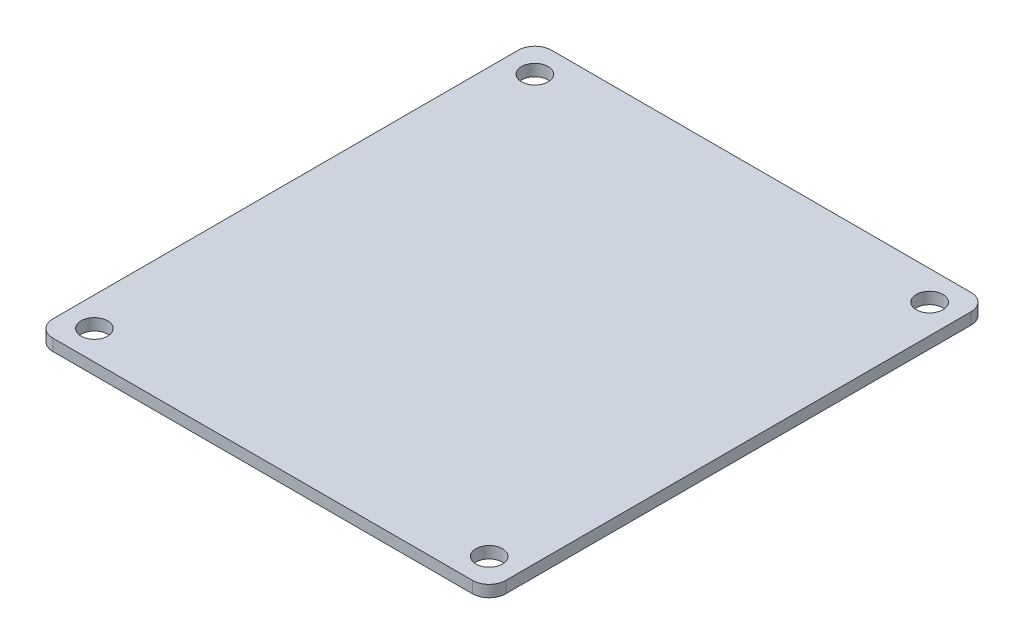
ISO-10303-21;
HEADER;
FILE_DESCRIPTION(('STEP AP214'),'2;1');
FILE_NAME('part.step','',(''),(''),'','','');
FILE_SCHEMA(('AUTOMOTIVE_DESIGN { 1 0 10303 214 1 1 1 1 }'));
ENDSEC;
DATA;
#1=APPLICATION_CONTEXT('core data for automotive mechanical design processes');
#2=APPLICATION_PROTOCOL_DEFINITION('international standard','automotive_design',2000,#1);
#3=PRODUCT_CONTEXT('',#1,'mechanical');
#4=PRODUCT('Part','Part','',(#3));
#5=PRODUCT_RELATED_PRODUCT_CATEGORY('part','',(#4));
#6=PRODUCT_DEFINITION_FORMATION('','',#4);
#7=PRODUCT_DEFINITION_CONTEXT('part definition',#1,'design');
#8=PRODUCT_DEFINITION('design','',#6,#7);
#9=PRODUCT_DEFINITION_SHAPE('','',#8);
#10=(LENGTH_UNIT() NAMED_UNIT(*) SI_UNIT(.MILLI.,.METRE.));
#11=(NAMED_UNIT(*) PLANE_ANGLE_UNIT() SI_UNIT($,.RADIAN.));
#12=(NAMED_UNIT(*) SI_UNIT($,.STERADIAN.) SOLID_ANGLE_UNIT());
#13=UNCERTAINTY_MEASURE_WITH_UNIT(LENGTH_MEASURE(1.E-05),#10,'distance_accuracy_value','');
#14=(GEOMETRIC_REPRESENTATION_CONTEXT(3) GLOBAL_UNCERTAINTY_ASSIGNED_CONTEXT((#13)) GLOBAL_UNIT_ASSIGNED_CONTEXT((#10,
#11,#12)) REPRESENTATION_CONTEXT('',''));
#15=CARTESIAN_POINT('',(0.,0.,0.));
#16=DIRECTION('',(0.,0.,1.));
#17=DIRECTION('',(1.,0.,0.));
#18=AXIS2_PLACEMENT_3D('',#15,#16,#17);
#19=CARTESIAN_POINT('',(-27.25,1.4,30.));
#20=DIRECTION('',(1.,0.,0.));
#21=DIRECTION('',(0.,0.,-1.));
#22=AXIS2_PLACEMENT_3D('',#19,#20,#21);
#23=PLANE('',#22);
#24=DIRECTION('',(0.,0.,1.));
#25=VECTOR('',#24,1.);
#26=CARTESIAN_POINT('',(-27.25,1.4,30.));
#27=LINE('',#26,#25);
#28=CARTESIAN_POINT('',(-27.25,1.4,-28.));
#29=VERTEX_POINT('',#28);
#30=CARTESIAN_POINT('',(-27.25,1.4,28.));
#31=VERTEX_POINT('',#30);
#32=EDGE_CURVE('E124',#29,#31,#27,.T.);
#33=ORIENTED_EDGE('',*,*,#32,.F.);
#34=DIRECTION('',(0.,-1.,0.));
#35=VECTOR('',#34,1.);
#36=CARTESIAN_POINT('',(-27.25,1.4,-28.));
#37=LINE('',#36,#35);
#38=CARTESIAN_POINT('',(-27.25,0.,-28.));
#39=VERTEX_POINT('',#38);
#40=EDGE_CURVE('E150',#29,#39,#37,.T.);
#41=ORIENTED_EDGE('',*,*,#40,.T.);
#42=DIRECTION('',(0.,0.,1.));
#43=VECTOR('',#42,1.);
#44=CARTESIAN_POINT('',(-27.25,0.,30.));
#45=LINE('',#44,#43);
#46=CARTESIAN_POINT('',(-27.25,0.,28.));
#47=VERTEX_POINT('',#46);
#48=EDGE_CURVE('E158',#39,#47,#45,.T.);
#49=ORIENTED_EDGE('',*,*,#48,.T.);
#50=DIRECTION('',(0.,-1.,0.));
#51=VECTOR('',#50,1.);
#52=CARTESIAN_POINT('',(-27.25,1.4,28.));
#53=LINE('',#52,#51);
#54=EDGE_CURVE('E148',#47,#31,#53,.F.);
#55=ORIENTED_EDGE('',*,*,#54,.T.);
#56=EDGE_LOOP('',(#33,#41,#49,#55));
#57=FACE_BOUND('',#56,.T.);
#58=ADVANCED_FACE('F33',(#57),#23,.F.);
#59=CARTESIAN_POINT('',(27.25,1.4,30.));
#60=DIRECTION('',(0.,0.,-1.));
#61=DIRECTION('',(-1.,0.,0.));
#62=AXIS2_PLACEMENT_3D('',#59,#60,#61);
#63=PLANE('',#62);
#64=DIRECTION('',(1.,0.,0.));
#65=VECTOR('',#64,1.);
#66=CARTESIAN_POINT('',(27.25,0.,30.));
#67=LINE('',#66,#65);
#68=CARTESIAN_POINT('',(-25.25,0.,30.));
#69=VERTEX_POINT('',#68);
#70=CARTESIAN_POINT('',(25.25,0.,30.));
#71=VERTEX_POINT('',#70);
#72=EDGE_CURVE('E129',#69,#71,#67,.T.);
#73=ORIENTED_EDGE('',*,*,#72,.T.);
#74=DIRECTION('',(0.,-1.,0.));
#75=VECTOR('',#74,1.);
#76=CARTESIAN_POINT('',(25.25,1.4,30.));
#77=LINE('',#76,#75);
#78=CARTESIAN_POINT('',(25.25,1.4,30.));
#79=VERTEX_POINT('',#78);
#80=EDGE_CURVE('E11',#71,#79,#77,.F.);
#81=ORIENTED_EDGE('',*,*,#80,.T.);
#82=DIRECTION('',(1.,0.,0.));
#83=VECTOR('',#82,1.);
#84=CARTESIAN_POINT('',(27.25,1.4,30.));
#85=LINE('',#84,#83);
#86=CARTESIAN_POINT('',(-25.25,1.4,30.));
#87=VERTEX_POINT('',#86);
#88=EDGE_CURVE('E127',#87,#79,#85,.T.);
#89=ORIENTED_EDGE('',*,*,#88,.F.);
#90=DIRECTION('',(0.,-1.,0.));
#91=VECTOR('',#90,1.);
#92=CARTESIAN_POINT('',(-25.25,1.4,30.));
#93=LINE('',#92,#91);
#94=EDGE_CURVE('E41',#87,#69,#93,.T.);
#95=ORIENTED_EDGE('',*,*,#94,.T.);
#96=EDGE_LOOP('',(#73,#81,#89,#95));
#97=FACE_BOUND('',#96,.T.);
#98=ADVANCED_FACE('F155',(#97),#63,.F.);
#99=CARTESIAN_POINT('',(27.25,1.4,30.));
#100=DIRECTION('',(-1.,0.,0.));
#101=DIRECTION('',(0.,0.,1.));
#102=AXIS2_PLACEMENT_3D('',#99,#100,#101);
#103=PLANE('',#102);
#104=DIRECTION('',(0.,0.,-1.));
#105=VECTOR('',#104,1.);
#106=CARTESIAN_POINT('',(27.25,0.,30.));
#107=LINE('',#106,#105);
#108=CARTESIAN_POINT('',(27.25,0.,28.));
#109=VERTEX_POINT('',#108);
#110=CARTESIAN_POINT('',(27.25,0.,-28.));
#111=VERTEX_POINT('',#110);
#112=EDGE_CURVE('E125',#109,#111,#107,.T.);
#113=ORIENTED_EDGE('',*,*,#112,.T.);
#114=DIRECTION('',(0.,-1.,0.));
#115=VECTOR('',#114,1.);
#116=CARTESIAN_POINT('',(27.25,1.4,-28.));
#117=LINE('',#116,#115);
#118=CARTESIAN_POINT('',(27.25,1.4,-28.));
#119=VERTEX_POINT('',#118);
#120=EDGE_CURVE('E103',#111,#119,#117,.F.);
#121=ORIENTED_EDGE('',*,*,#120,.T.);
#122=DIRECTION('',(0.,0.,-1.));
#123=VECTOR('',#122,1.);
#124=CARTESIAN_POINT('',(27.25,1.4,30.));
#125=LINE('',#124,#123);
#126=CARTESIAN_POINT('',(27.25,1.4,28.));
#127=VERTEX_POINT('',#126);
#128=EDGE_CURVE('E163',#127,#119,#125,.T.);
#129=ORIENTED_EDGE('',*,*,#128,.F.);
#130=DIRECTION('',(0.,-1.,0.));
#131=VECTOR('',#130,1.);
#132=CARTESIAN_POINT('',(27.25,1.4,28.));
#133=LINE('',#132,#131);
#134=EDGE_CURVE('E108',#127,#109,#133,.T.);
#135=ORIENTED_EDGE('',*,*,#134,.T.);
#136=EDGE_LOOP('',(#113,#121,#129,#135));
#137=FACE_BOUND('',#136,.T.);
#138=ADVANCED_FACE('F211',(#137),#103,.F.);
#139=CARTESIAN_POINT('',(27.25,1.4,-30.));
#140=DIRECTION('',(0.,0.,1.));
#141=DIRECTION('',(1.,0.,0.));
#142=AXIS2_PLACEMENT_3D('',#139,#140,#141);
#143=PLANE('',#142);
#144=DIRECTION('',(-1.,0.,0.));
#145=VECTOR('',#144,1.);
#146=CARTESIAN_POINT('',(27.25,1.4,-30.));
#147=LINE('',#146,#145);
#148=CARTESIAN_POINT('',(25.25,1.4,-30.));
#149=VERTEX_POINT('',#148);
#150=CARTESIAN_POINT('',(-25.25,1.4,-30.));
#151=VERTEX_POINT('',#150);
#152=EDGE_CURVE('E118',#149,#151,#147,.T.);
#153=ORIENTED_EDGE('',*,*,#152,.F.);
#154=DIRECTION('',(0.,-1.,0.));
#155=VECTOR('',#154,1.);
#156=CARTESIAN_POINT('',(25.25,1.4,-30.));
#157=LINE('',#156,#155);
#158=CARTESIAN_POINT('',(25.25,0.,-30.));
#159=VERTEX_POINT('',#158);
#160=EDGE_CURVE('E102',#149,#159,#157,.T.);
#161=ORIENTED_EDGE('',*,*,#160,.T.);
#162=DIRECTION('',(-1.,0.,0.));
#163=VECTOR('',#162,1.);
#164=CARTESIAN_POINT('',(27.25,0.,-30.));
#165=LINE('',#164,#163);
#166=CARTESIAN_POINT('',(-25.25,0.,-30.));
#167=VERTEX_POINT('',#166);
#168=EDGE_CURVE('E115',#159,#167,#165,.T.);
#169=ORIENTED_EDGE('',*,*,#168,.T.);
#170=DIRECTION('',(0.,-1.,0.));
#171=VECTOR('',#170,1.);
#172=CARTESIAN_POINT('',(-25.25,1.4,-30.));
#173=LINE('',#172,#171);
#174=EDGE_CURVE('E120',#167,#151,#173,.F.);
#175=ORIENTED_EDGE('',*,*,#174,.T.);
#176=EDGE_LOOP('',(#153,#161,#169,#175));
#177=FACE_BOUND('',#176,.T.);
#178=ADVANCED_FACE('F114',(#177),#143,.F.);
#179=CARTESIAN_POINT('',(0.,1.4,0.));
#180=DIRECTION('',(0.,1.,0.));
#181=DIRECTION('',(0.,0.,1.));
#182=AXIS2_PLACEMENT_3D('',#179,#180,#181);
#183=PLANE('',#182);
#184=CARTESIAN_POINT('',(23.75,1.4,26.5));
#185=DIRECTION('',(0.,1.,0.));
#186=DIRECTION('',(0.,0.,1.));
#187=AXIS2_PLACEMENT_3D('',#184,#185,#186);
#188=CIRCLE('',#187,1.6);
#189=CARTESIAN_POINT('',(23.75,1.4,28.1));
#190=VERTEX_POINT('',#189);
#191=EDGE_CURVE('E173',#190,#190,#188,.T.);
#192=ORIENTED_EDGE('',*,*,#191,.F.);
#193=EDGE_LOOP('',(#192));
#194=FACE_BOUND('',#193,.T.);
#195=CARTESIAN_POINT('',(-23.75,1.4,-26.5));
#196=DIRECTION('',(0.,1.,0.));
#197=DIRECTION('',(0.,0.,1.));
#198=AXIS2_PLACEMENT_3D('',#195,#196,#197);
#199=CIRCLE('',#198,1.6);
#200=CARTESIAN_POINT('',(-23.75,1.4,-24.9));
#201=VERTEX_POINT('',#200);
#202=EDGE_CURVE('E179',#201,#201,#199,.T.);
#203=ORIENTED_EDGE('',*,*,#202,.F.);
#204=EDGE_LOOP('',(#203));
#205=FACE_BOUND('',#204,.T.);
#206=CARTESIAN_POINT('',(-23.75,1.4,26.5));
#207=DIRECTION('',(0.,1.,0.));
#208=DIRECTION('',(0.,0.,1.));
#209=AXIS2_PLACEMENT_3D('',#206,#207,#208);
#210=CIRCLE('',#209,1.6);
#211=CARTESIAN_POINT('',(-23.75,1.4,28.1));
#212=VERTEX_POINT('',#211);
#213=EDGE_CURVE('E185',#212,#212,#210,.T.);
#214=ORIENTED_EDGE('',*,*,#213,.F.);
#215=EDGE_LOOP('',(#214));
#216=FACE_BOUND('',#215,.T.);
#217=CARTESIAN_POINT('',(23.75,1.4,-26.5));
#218=DIRECTION('',(0.,1.,0.));
#219=DIRECTION('',(0.,0.,1.));
#220=AXIS2_PLACEMENT_3D('',#217,#218,#219);
#221=CIRCLE('',#220,1.6);
#222=CARTESIAN_POINT('',(23.75,1.4,-24.9));
#223=VERTEX_POINT('',#222);
#224=EDGE_CURVE('E167',#223,#223,#221,.T.);
#225=ORIENTED_EDGE('',*,*,#224,.F.);
#226=EDGE_LOOP('',(#225));
#227=FACE_BOUND('',#226,.T.);
#228=ORIENTED_EDGE('',*,*,#128,.T.);
#229=CARTESIAN_POINT('',(25.25,1.4,-28.));
#230=DIRECTION('',(0.,1.,0.));
#231=DIRECTION('',(0.,0.,1.));
#232=AXIS2_PLACEMENT_3D('',#229,#230,#231);
#233=CIRCLE('',#232,2.);
#234=EDGE_CURVE('E146',#119,#149,#233,.T.);
#235=ORIENTED_EDGE('',*,*,#234,.T.);
#236=ORIENTED_EDGE('',*,*,#152,.T.);
#237=CARTESIAN_POINT('',(-25.25,1.4,-28.));
#238=DIRECTION('',(0.,1.,0.));
#239=DIRECTION('',(0.,0.,1.));
#240=AXIS2_PLACEMENT_3D('',#237,#238,#239);
#241=CIRCLE('',#240,2.);
#242=EDGE_CURVE('E144',#151,#29,#241,.T.);
#243=ORIENTED_EDGE('',*,*,#242,.T.);
#244=ORIENTED_EDGE('',*,*,#32,.T.);
#245=CARTESIAN_POINT('',(-25.25,1.4,28.));
#246=DIRECTION('',(0.,1.,0.));
#247=DIRECTION('',(0.,0.,1.));
#248=AXIS2_PLACEMENT_3D('',#245,#246,#247);
#249=CIRCLE('',#248,2.);
#250=EDGE_CURVE('E53',#31,#87,#249,.T.);
#251=ORIENTED_EDGE('',*,*,#250,.T.);
#252=ORIENTED_EDGE('',*,*,#88,.T.);
#253=CARTESIAN_POINT('',(25.25,1.4,28.));
#254=DIRECTION('',(0.,1.,0.));
#255=DIRECTION('',(0.,0.,1.));
#256=AXIS2_PLACEMENT_3D('',#253,#254,#255);
#257=CIRCLE('',#256,2.);
#258=EDGE_CURVE('E142',#79,#127,#257,.T.);
#259=ORIENTED_EDGE('',*,*,#258,.T.);
#260=EDGE_LOOP('',(#228,#235,#236,#243,#244,#251,#252,#259));
#261=FACE_BOUND('',#260,.T.);
#262=ADVANCED_FACE('F201',(#194,#205,#216,#227,#261),#183,.T.);
#263=CARTESIAN_POINT('',(0.,0.,0.));
#264=DIRECTION('',(0.,1.,0.));
#265=DIRECTION('',(0.,0.,1.));
#266=AXIS2_PLACEMENT_3D('',#263,#264,#265);
#267=PLANE('',#266);
#268=CARTESIAN_POINT('',(23.75,0.,26.5));
#269=DIRECTION('',(0.,1.,0.));
#270=DIRECTION('',(0.,0.,1.));
#271=AXIS2_PLACEMENT_3D('',#268,#269,#270);
#272=CIRCLE('',#271,1.6);
#273=CARTESIAN_POINT('',(23.75,0.,28.1));
#274=VERTEX_POINT('',#273);
#275=EDGE_CURVE('E176',#274,#274,#272,.T.);
#276=ORIENTED_EDGE('',*,*,#275,.T.);
#277=EDGE_LOOP('',(#276));
#278=FACE_BOUND('',#277,.T.);
#279=CARTESIAN_POINT('',(-23.75,0.,-26.5));
#280=DIRECTION('',(0.,1.,0.));
#281=DIRECTION('',(0.,0.,1.));
#282=AXIS2_PLACEMENT_3D('',#279,#280,#281);
#283=CIRCLE('',#282,1.6);
#284=CARTESIAN_POINT('',(-23.75,0.,-24.9));
#285=VERTEX_POINT('',#284);
#286=EDGE_CURVE('E182',#285,#285,#283,.T.);
#287=ORIENTED_EDGE('',*,*,#286,.T.);
#288=EDGE_LOOP('',(#287));
#289=FACE_BOUND('',#288,.T.);
#290=CARTESIAN_POINT('',(-23.75,0.,26.5));
#291=DIRECTION('',(0.,1.,0.));
#292=DIRECTION('',(0.,0.,1.));
#293=AXIS2_PLACEMENT_3D('',#290,#291,#292);
#294=CIRCLE('',#293,1.6);
#295=CARTESIAN_POINT('',(-23.75,0.,28.1));
#296=VERTEX_POINT('',#295);
#297=EDGE_CURVE('E170',#296,#296,#294,.T.);
#298=ORIENTED_EDGE('',*,*,#297,.T.);
#299=EDGE_LOOP('',(#298));
#300=FACE_BOUND('',#299,.T.);
#301=CARTESIAN_POINT('',(23.75,0.,-26.5));
#302=DIRECTION('',(0.,1.,0.));
#303=DIRECTION('',(0.,0.,1.));
#304=AXIS2_PLACEMENT_3D('',#301,#302,#303);
#305=CIRCLE('',#304,1.6);
#306=CARTESIAN_POINT('',(23.75,0.,-24.9));
#307=VERTEX_POINT('',#306);
#308=EDGE_CURVE('E159',#307,#307,#305,.T.);
#309=ORIENTED_EDGE('',*,*,#308,.T.);
#310=EDGE_LOOP('',(#309));
#311=FACE_BOUND('',#310,.T.);
#312=ORIENTED_EDGE('',*,*,#168,.F.);
#313=CARTESIAN_POINT('',(25.25,0.,-28.));
#314=DIRECTION('',(0.,1.,0.));
#315=DIRECTION('',(0.,0.,1.));
#316=AXIS2_PLACEMENT_3D('',#313,#314,#315);
#317=CIRCLE('',#316,2.);
#318=EDGE_CURVE('E98',#159,#111,#317,.F.);
#319=ORIENTED_EDGE('',*,*,#318,.T.);
#320=ORIENTED_EDGE('',*,*,#112,.F.);
#321=CARTESIAN_POINT('',(25.25,0.,28.));
#322=DIRECTION('',(0.,1.,0.));
#323=DIRECTION('',(0.,0.,1.));
#324=AXIS2_PLACEMENT_3D('',#321,#322,#323);
#325=CIRCLE('',#324,2.);
#326=EDGE_CURVE('E135',#109,#71,#325,.F.);
#327=ORIENTED_EDGE('',*,*,#326,.T.);
#328=ORIENTED_EDGE('',*,*,#72,.F.);
#329=CARTESIAN_POINT('',(-25.25,0.,28.));
#330=DIRECTION('',(0.,1.,0.));
#331=DIRECTION('',(0.,0.,1.));
#332=AXIS2_PLACEMENT_3D('',#329,#330,#331);
#333=CIRCLE('',#332,2.);
#334=EDGE_CURVE('E119',#69,#47,#333,.F.);
#335=ORIENTED_EDGE('',*,*,#334,.T.);
#336=ORIENTED_EDGE('',*,*,#48,.F.);
#337=CARTESIAN_POINT('',(-25.25,0.,-28.));
#338=DIRECTION('',(0.,1.,0.));
#339=DIRECTION('',(0.,0.,1.));
#340=AXIS2_PLACEMENT_3D('',#337,#338,#339);
#341=CIRCLE('',#340,2.);
#342=EDGE_CURVE('E109',#39,#167,#341,.F.);
#343=ORIENTED_EDGE('',*,*,#342,.T.);
#344=EDGE_LOOP('',(#312,#319,#320,#327,#328,#335,#336,#343));
#345=FACE_BOUND('',#344,.T.);
#346=ADVANCED_FACE('F122',(#278,#289,#300,#311,#345),#267,.F.);
#347=CARTESIAN_POINT('',(23.75,0.,-26.5));
#348=DIRECTION('',(0.,1.,0.));
#349=DIRECTION('',(0.,0.,1.));
#350=AXIS2_PLACEMENT_3D('',#347,#348,#349);
#351=CYLINDRICAL_SURFACE('',#350,1.6);
#352=ORIENTED_EDGE('',*,*,#308,.F.);
#353=EDGE_LOOP('',(#352));
#354=FACE_BOUND('',#353,.T.);
#355=ORIENTED_EDGE('',*,*,#224,.T.);
#356=EDGE_LOOP('',(#355));
#357=FACE_BOUND('',#356,.T.);
#358=ADVANCED_FACE('F197',(#354,#357),#351,.F.);
#359=CARTESIAN_POINT('',(-23.75,0.,26.5));
#360=DIRECTION('',(0.,1.,0.));
#361=DIRECTION('',(0.,0.,1.));
#362=AXIS2_PLACEMENT_3D('',#359,#360,#361);
#363=CYLINDRICAL_SURFACE('',#362,1.6);
#364=ORIENTED_EDGE('',*,*,#297,.F.);
#365=EDGE_LOOP('',(#364));
#366=FACE_BOUND('',#365,.T.);
#367=ORIENTED_EDGE('',*,*,#213,.T.);
#368=EDGE_LOOP('',(#367));
#369=FACE_BOUND('',#368,.T.);
#370=ADVANCED_FACE('F193',(#366,#369),#363,.F.);
#371=CARTESIAN_POINT('',(-23.75,0.,-26.5));
#372=DIRECTION('',(0.,1.,0.));
#373=DIRECTION('',(0.,0.,1.));
#374=AXIS2_PLACEMENT_3D('',#371,#372,#373);
#375=CYLINDRICAL_SURFACE('',#374,1.6);
#376=ORIENTED_EDGE('',*,*,#286,.F.);
#377=EDGE_LOOP('',(#376));
#378=FACE_BOUND('',#377,.T.);
#379=ORIENTED_EDGE('',*,*,#202,.T.);
#380=EDGE_LOOP('',(#379));
#381=FACE_BOUND('',#380,.T.);
#382=ADVANCED_FACE('F196',(#378,#381),#375,.F.);
#383=CARTESIAN_POINT('',(23.75,0.,26.5));
#384=DIRECTION('',(0.,1.,0.));
#385=DIRECTION('',(0.,0.,1.));
#386=AXIS2_PLACEMENT_3D('',#383,#384,#385);
#387=CYLINDRICAL_SURFACE('',#386,1.6);
#388=ORIENTED_EDGE('',*,*,#275,.F.);
#389=EDGE_LOOP('',(#388));
#390=FACE_BOUND('',#389,.T.);
#391=ORIENTED_EDGE('',*,*,#191,.T.);
#392=EDGE_LOOP('',(#391));
#393=FACE_BOUND('',#392,.T.);
#394=ADVANCED_FACE('F234',(#390,#393),#387,.F.);
#395=CARTESIAN_POINT('',(25.25,1.4,-28.));
#396=DIRECTION('',(0.,-1.,0.));
#397=DIRECTION('',(0.,0.,-1.));
#398=AXIS2_PLACEMENT_3D('',#395,#396,#397);
#399=CYLINDRICAL_SURFACE('',#398,2.);
#400=ORIENTED_EDGE('',*,*,#234,.F.);
#401=ORIENTED_EDGE('',*,*,#120,.F.);
#402=ORIENTED_EDGE('',*,*,#318,.F.);
#403=ORIENTED_EDGE('',*,*,#160,.F.);
#404=EDGE_LOOP('',(#400,#401,#402,#403));
#405=FACE_BOUND('',#404,.T.);
#406=ADVANCED_FACE('F101',(#405),#399,.T.);
#407=CARTESIAN_POINT('',(-25.25,1.4,-28.));
#408=DIRECTION('',(0.,-1.,0.));
#409=DIRECTION('',(0.,0.,-1.));
#410=AXIS2_PLACEMENT_3D('',#407,#408,#409);
#411=CYLINDRICAL_SURFACE('',#410,2.);
#412=ORIENTED_EDGE('',*,*,#242,.F.);
#413=ORIENTED_EDGE('',*,*,#174,.F.);
#414=ORIENTED_EDGE('',*,*,#342,.F.);
#415=ORIENTED_EDGE('',*,*,#40,.F.);
#416=EDGE_LOOP('',(#412,#413,#414,#415));
#417=FACE_BOUND('',#416,.T.);
#418=ADVANCED_FACE('F215',(#417),#411,.T.);
#419=CARTESIAN_POINT('',(25.25,1.4,28.));
#420=DIRECTION('',(0.,-1.,0.));
#421=DIRECTION('',(0.,0.,-1.));
#422=AXIS2_PLACEMENT_3D('',#419,#420,#421);
#423=CYLINDRICAL_SURFACE('',#422,2.);
#424=ORIENTED_EDGE('',*,*,#258,.F.);
#425=ORIENTED_EDGE('',*,*,#80,.F.);
#426=ORIENTED_EDGE('',*,*,#326,.F.);
#427=ORIENTED_EDGE('',*,*,#134,.F.);
#428=EDGE_LOOP('',(#424,#425,#426,#427));
#429=FACE_BOUND('',#428,.T.);
#430=ADVANCED_FACE('F213',(#429),#423,.T.);
#431=CARTESIAN_POINT('',(-25.25,1.4,28.));
#432=DIRECTION('',(0.,-1.,0.));
#433=DIRECTION('',(0.,0.,-1.));
#434=AXIS2_PLACEMENT_3D('',#431,#432,#433);
#435=CYLINDRICAL_SURFACE('',#434,2.);
#436=ORIENTED_EDGE('',*,*,#250,.F.);
#437=ORIENTED_EDGE('',*,*,#54,.F.);
#438=ORIENTED_EDGE('',*,*,#334,.F.);
#439=ORIENTED_EDGE('',*,*,#94,.F.);
#440=EDGE_LOOP('',(#436,#437,#438,#439));
#441=FACE_BOUND('',#440,.T.);
#442=ADVANCED_FACE('F35',(#441),#435,.T.);
#443=CLOSED_SHELL('',(#58,#98,#138,#178,#262,#346,#358,#370,#382,#394,#406,#418,#430,#442));
#444=MANIFOLD_SOLID_BREP('B2',#443);
#445=ADVANCED_BREP_SHAPE_REPRESENTATION('',(#18,#444),#14);
#446=SHAPE_DEFINITION_REPRESENTATION(#9,#445);
ENDSEC;
END-ISO-10303-21;
